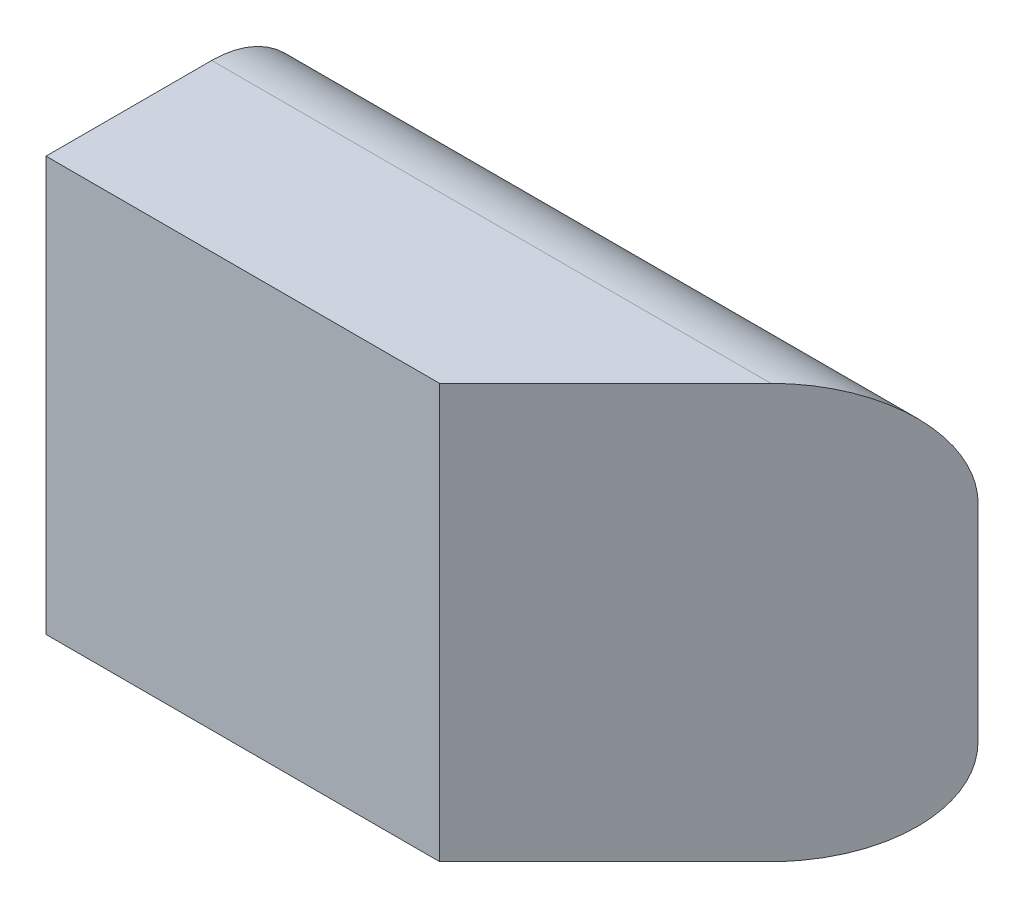
ISO-10303-21;
HEADER;
FILE_DESCRIPTION(('STEP AP214'),'2;1');
FILE_NAME('part.step','',(''),(''),'','','');
FILE_SCHEMA(('AUTOMOTIVE_DESIGN { 1 0 10303 214 1 1 1 1 }'));
ENDSEC;
DATA;
#1=APPLICATION_CONTEXT('core data for automotive mechanical design processes');
#2=APPLICATION_PROTOCOL_DEFINITION('international standard','automotive_design',2000,#1);
#3=PRODUCT_CONTEXT('',#1,'mechanical');
#4=PRODUCT('Part','Part','',(#3));
#5=PRODUCT_RELATED_PRODUCT_CATEGORY('part','',(#4));
#6=PRODUCT_DEFINITION_FORMATION('','',#4);
#7=PRODUCT_DEFINITION_CONTEXT('part definition',#1,'design');
#8=PRODUCT_DEFINITION('design','',#6,#7);
#9=PRODUCT_DEFINITION_SHAPE('','',#8);
#10=(LENGTH_UNIT() NAMED_UNIT(*) SI_UNIT(.MILLI.,.METRE.));
#11=(NAMED_UNIT(*) PLANE_ANGLE_UNIT() SI_UNIT($,.RADIAN.));
#12=(NAMED_UNIT(*) SI_UNIT($,.STERADIAN.) SOLID_ANGLE_UNIT());
#13=UNCERTAINTY_MEASURE_WITH_UNIT(LENGTH_MEASURE(1.E-05),#10,'distance_accuracy_value','');
#14=(GEOMETRIC_REPRESENTATION_CONTEXT(3) GLOBAL_UNCERTAINTY_ASSIGNED_CONTEXT((#13)) GLOBAL_UNIT_ASSIGNED_CONTEXT((#10,
#11,#12)) REPRESENTATION_CONTEXT('',''));
#15=CARTESIAN_POINT('',(0.,0.,0.));
#16=DIRECTION('',(0.,0.,1.));
#17=DIRECTION('',(1.,0.,0.));
#18=AXIS2_PLACEMENT_3D('',#15,#16,#17);
#19=CARTESIAN_POINT('',(203.2,0.,0.));
#20=DIRECTION('',(0.,1.,0.));
#21=DIRECTION('',(0.,0.,1.));
#22=AXIS2_PLACEMENT_3D('',#19,#20,#21);
#23=PLANE('',#22);
#24=DIRECTION('',(-1.,0.,0.));
#25=VECTOR('',#24,1.);
#26=CARTESIAN_POINT('',(203.2,0.,-31.75));
#27=LINE('',#26,#25);
#28=CARTESIAN_POINT('',(171.45,0.,-31.75));
#29=VERTEX_POINT('',#28);
#30=CARTESIAN_POINT('',(0.,0.,-31.75));
#31=VERTEX_POINT('',#30);
#32=EDGE_CURVE('E11',#29,#31,#27,.T.);
#33=ORIENTED_EDGE('',*,*,#32,.F.);
#34=DIRECTION('',(-0.707106781186549,0.,0.707106781186546));
#35=VECTOR('',#34,1.);
#36=CARTESIAN_POINT('',(171.45,0.,-31.7500000000001));
#37=LINE('',#36,#35);
#38=CARTESIAN_POINT('',(120.65,0.,19.05));
#39=VERTEX_POINT('',#38);
#40=EDGE_CURVE('E122',#29,#39,#37,.T.);
#41=ORIENTED_EDGE('',*,*,#40,.T.);
#42=DIRECTION('',(-1.,0.,0.));
#43=VECTOR('',#42,1.);
#44=CARTESIAN_POINT('',(203.2,0.,19.05));
#45=LINE('',#44,#43);
#46=CARTESIAN_POINT('',(0.,0.,19.05));
#47=VERTEX_POINT('',#46);
#48=EDGE_CURVE('E83',#39,#47,#45,.T.);
#49=ORIENTED_EDGE('',*,*,#48,.T.);
#50=DIRECTION('',(0.,0.,-1.));
#51=VECTOR('',#50,1.);
#52=CARTESIAN_POINT('',(0.,0.,0.));
#53=LINE('',#52,#51);
#54=EDGE_CURVE('E98',#47,#31,#53,.T.);
#55=ORIENTED_EDGE('',*,*,#54,.T.);
#56=EDGE_LOOP('',(#33,#41,#49,#55));
#57=FACE_BOUND('',#56,.T.);
#58=ADVANCED_FACE('F33',(#57),#23,.F.);
#59=CARTESIAN_POINT('',(203.2,31.75,-31.75));
#60=DIRECTION('',(-1.,0.,0.));
#61=DIRECTION('',(0.,0.,1.));
#62=AXIS2_PLACEMENT_3D('',#59,#60,#61);
#63=CYLINDRICAL_SURFACE('',#62,31.75);
#64=DIRECTION('',(-1.,0.,0.));
#65=VECTOR('',#64,1.);
#66=CARTESIAN_POINT('',(203.2,31.75,-63.5));
#67=LINE('',#66,#65);
#68=CARTESIAN_POINT('',(203.2,31.75,-63.5));
#69=VERTEX_POINT('',#68);
#70=CARTESIAN_POINT('',(0.,31.75,-63.5));
#71=VERTEX_POINT('',#70);
#72=EDGE_CURVE('E41',#69,#71,#67,.T.);
#73=ORIENTED_EDGE('',*,*,#72,.F.);
#74=CARTESIAN_POINT('',(171.45,31.75,-31.75));
#75=DIRECTION('',(-0.707106781186546,0.,-0.707106781186549));
#76=DIRECTION('',(-0.707106781186549,0.,0.707106781186546));
#77=AXIS2_PLACEMENT_3D('',#74,#75,#76);
#78=ELLIPSE('',#77,44.9012806053459,31.75);
#79=EDGE_CURVE('E48',#69,#29,#78,.T.);
#80=ORIENTED_EDGE('',*,*,#79,.T.);
#81=ORIENTED_EDGE('',*,*,#32,.T.);
#82=CARTESIAN_POINT('',(0.,31.75,-31.75));
#83=DIRECTION('',(1.,0.,0.));
#84=DIRECTION('',(0.,0.,-1.));
#85=AXIS2_PLACEMENT_3D('',#82,#83,#84);
#86=CIRCLE('',#85,31.75);
#87=EDGE_CURVE('E116',#31,#71,#86,.T.);
#88=ORIENTED_EDGE('',*,*,#87,.T.);
#89=EDGE_LOOP('',(#73,#80,#81,#88));
#90=FACE_BOUND('',#89,.T.);
#91=ADVANCED_FACE('F143',(#90),#63,.T.);
#92=CARTESIAN_POINT('',(203.2,95.25,-63.5));
#93=DIRECTION('',(0.,0.,1.));
#94=DIRECTION('',(1.,0.,0.));
#95=AXIS2_PLACEMENT_3D('',#92,#93,#94);
#96=PLANE('',#95);
#97=DIRECTION('',(0.,1.,0.));
#98=VECTOR('',#97,1.);
#99=CARTESIAN_POINT('',(0.,95.25,-63.5));
#100=LINE('',#99,#98);
#101=CARTESIAN_POINT('',(0.,95.25,-63.5));
#102=VERTEX_POINT('',#101);
#103=EDGE_CURVE('E114',#71,#102,#100,.T.);
#104=ORIENTED_EDGE('',*,*,#103,.T.);
#105=DIRECTION('',(-1.,0.,0.));
#106=VECTOR('',#105,1.);
#107=CARTESIAN_POINT('',(203.2,95.25,-63.5));
#108=LINE('',#107,#106);
#109=CARTESIAN_POINT('',(203.2,95.25,-63.5));
#110=VERTEX_POINT('',#109);
#111=EDGE_CURVE('E106',#110,#102,#108,.T.);
#112=ORIENTED_EDGE('',*,*,#111,.F.);
#113=DIRECTION('',(0.,1.,0.));
#114=VECTOR('',#113,1.);
#115=CARTESIAN_POINT('',(203.2,95.25,-63.5));
#116=LINE('',#115,#114);
#117=EDGE_CURVE('E99',#69,#110,#116,.T.);
#118=ORIENTED_EDGE('',*,*,#117,.F.);
#119=ORIENTED_EDGE('',*,*,#72,.T.);
#120=EDGE_LOOP('',(#104,#112,#118,#119));
#121=FACE_BOUND('',#120,.T.);
#122=ADVANCED_FACE('F112',(#121),#96,.F.);
#123=CARTESIAN_POINT('',(203.2,95.25,-31.75));
#124=DIRECTION('',(-1.,0.,0.));
#125=DIRECTION('',(0.,0.,1.));
#126=AXIS2_PLACEMENT_3D('',#123,#124,#125);
#127=CYLINDRICAL_SURFACE('',#126,31.75);
#128=DIRECTION('',(-1.,0.,0.));
#129=VECTOR('',#128,1.);
#130=CARTESIAN_POINT('',(203.2,127.,-31.75));
#131=LINE('',#130,#129);
#132=CARTESIAN_POINT('',(171.45,127.,-31.75));
#133=VERTEX_POINT('',#132);
#134=CARTESIAN_POINT('',(0.,127.,-31.75));
#135=VERTEX_POINT('',#134);
#136=EDGE_CURVE('E82',#133,#135,#131,.T.);
#137=ORIENTED_EDGE('',*,*,#136,.F.);
#138=CARTESIAN_POINT('',(171.45,95.25,-31.75));
#139=DIRECTION('',(-0.707106781186546,0.,-0.707106781186549));
#140=DIRECTION('',(-0.707106781186549,0.,0.707106781186546));
#141=AXIS2_PLACEMENT_3D('',#138,#139,#140);
#142=ELLIPSE('',#141,44.9012806053459,31.75);
#143=EDGE_CURVE('E128',#133,#110,#142,.T.);
#144=ORIENTED_EDGE('',*,*,#143,.T.);
#145=ORIENTED_EDGE('',*,*,#111,.T.);
#146=CARTESIAN_POINT('',(0.,95.25,-31.75));
#147=DIRECTION('',(1.,0.,0.));
#148=DIRECTION('',(0.,0.,-1.));
#149=AXIS2_PLACEMENT_3D('',#146,#147,#148);
#150=CIRCLE('',#149,31.75);
#151=EDGE_CURVE('E92',#102,#135,#150,.T.);
#152=ORIENTED_EDGE('',*,*,#151,.T.);
#153=EDGE_LOOP('',(#137,#144,#145,#152));
#154=FACE_BOUND('',#153,.T.);
#155=ADVANCED_FACE('F133',(#154),#127,.T.);
#156=CARTESIAN_POINT('',(203.2,127.,19.05));
#157=DIRECTION('',(0.,-1.,0.));
#158=DIRECTION('',(0.,0.,-1.));
#159=AXIS2_PLACEMENT_3D('',#156,#157,#158);
#160=PLANE('',#159);
#161=DIRECTION('',(-1.,0.,0.));
#162=VECTOR('',#161,1.);
#163=CARTESIAN_POINT('',(203.2,127.,19.05));
#164=LINE('',#163,#162);
#165=CARTESIAN_POINT('',(120.65,127.,19.05));
#166=VERTEX_POINT('',#165);
#167=CARTESIAN_POINT('',(0.,127.,19.05));
#168=VERTEX_POINT('',#167);
#169=EDGE_CURVE('E71',#166,#168,#164,.T.);
#170=ORIENTED_EDGE('',*,*,#169,.F.);
#171=DIRECTION('',(0.707106781186549,0.,-0.707106781186546));
#172=VECTOR('',#171,1.);
#173=CARTESIAN_POINT('',(161.925,127.,-22.2250000000001));
#174=LINE('',#173,#172);
#175=EDGE_CURVE('E126',#166,#133,#174,.T.);
#176=ORIENTED_EDGE('',*,*,#175,.T.);
#177=ORIENTED_EDGE('',*,*,#136,.T.);
#178=DIRECTION('',(0.,0.,1.));
#179=VECTOR('',#178,1.);
#180=CARTESIAN_POINT('',(0.,127.,19.05));
#181=LINE('',#180,#179);
#182=EDGE_CURVE('E86',#135,#168,#181,.T.);
#183=ORIENTED_EDGE('',*,*,#182,.T.);
#184=EDGE_LOOP('',(#170,#176,#177,#183));
#185=FACE_BOUND('',#184,.T.);
#186=ADVANCED_FACE('F87',(#185),#160,.F.);
#187=CARTESIAN_POINT('',(203.2,0.,19.05));
#188=DIRECTION('',(0.,0.,-1.));
#189=DIRECTION('',(-1.,0.,0.));
#190=AXIS2_PLACEMENT_3D('',#187,#188,#189);
#191=PLANE('',#190);
#192=ORIENTED_EDGE('',*,*,#48,.F.);
#193=DIRECTION('',(0.,1.,0.));
#194=VECTOR('',#193,1.);
#195=CARTESIAN_POINT('',(120.65,0.,19.05));
#196=LINE('',#195,#194);
#197=EDGE_CURVE('E79',#39,#166,#196,.T.);
#198=ORIENTED_EDGE('',*,*,#197,.T.);
#199=ORIENTED_EDGE('',*,*,#169,.T.);
#200=DIRECTION('',(0.,-1.,0.));
#201=VECTOR('',#200,1.);
#202=CARTESIAN_POINT('',(0.,0.,19.05));
#203=LINE('',#202,#201);
#204=EDGE_CURVE('E76',#168,#47,#203,.T.);
#205=ORIENTED_EDGE('',*,*,#204,.T.);
#206=EDGE_LOOP('',(#192,#198,#199,#205));
#207=FACE_BOUND('',#206,.T.);
#208=ADVANCED_FACE('F74',(#207),#191,.F.);
#209=CARTESIAN_POINT('',(0.,95.25,-31.75));
#210=DIRECTION('',(1.,0.,0.));
#211=DIRECTION('',(0.,0.,-1.));
#212=AXIS2_PLACEMENT_3D('',#209,#210,#211);
#213=PLANE('',#212);
#214=ORIENTED_EDGE('',*,*,#54,.F.);
#215=ORIENTED_EDGE('',*,*,#204,.F.);
#216=ORIENTED_EDGE('',*,*,#182,.F.);
#217=ORIENTED_EDGE('',*,*,#151,.F.);
#218=ORIENTED_EDGE('',*,*,#103,.F.);
#219=ORIENTED_EDGE('',*,*,#87,.F.);
#220=EDGE_LOOP('',(#214,#215,#216,#217,#218,#219));
#221=FACE_BOUND('',#220,.T.);
#222=ADVANCED_FACE('F95',(#221),#213,.F.);
#223=CARTESIAN_POINT('',(69.8499999999996,0.,69.8499999999999));
#224=DIRECTION('',(-0.707106781186546,0.,-0.707106781186549));
#225=DIRECTION('',(-0.707106781186549,0.,0.707106781186546));
#226=AXIS2_PLACEMENT_3D('',#223,#224,#225);
#227=PLANE('',#226);
#228=ORIENTED_EDGE('',*,*,#117,.T.);
#229=ORIENTED_EDGE('',*,*,#143,.F.);
#230=ORIENTED_EDGE('',*,*,#175,.F.);
#231=ORIENTED_EDGE('',*,*,#197,.F.);
#232=ORIENTED_EDGE('',*,*,#40,.F.);
#233=ORIENTED_EDGE('',*,*,#79,.F.);
#234=EDGE_LOOP('',(#228,#229,#230,#231,#232,#233));
#235=FACE_BOUND('',#234,.T.);
#236=ADVANCED_FACE('F137',(#235),#227,.F.);
#237=CLOSED_SHELL('',(#58,#91,#122,#155,#186,#208,#222,#236));
#238=MANIFOLD_SOLID_BREP('B2',#237);
#239=ADVANCED_BREP_SHAPE_REPRESENTATION('',(#18,#238),#14);
#240=SHAPE_DEFINITION_REPRESENTATION(#9,#239);
ENDSEC;
END-ISO-10303-21;
